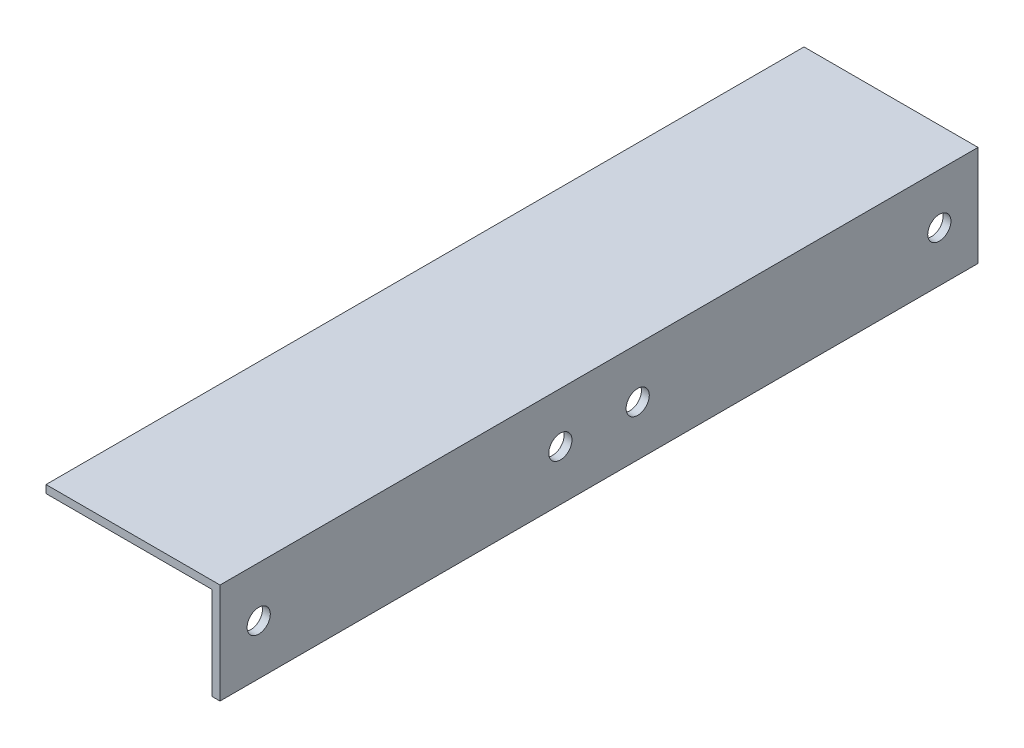
ISO-10303-21;
HEADER;
FILE_DESCRIPTION(('STEP AP214'),'2;1');
FILE_NAME('part.step','',(''),(''),'','','');
FILE_SCHEMA(('AUTOMOTIVE_DESIGN { 1 0 10303 214 1 1 1 1 }'));
ENDSEC;
DATA;
#1=APPLICATION_CONTEXT('core data for automotive mechanical design processes');
#2=APPLICATION_PROTOCOL_DEFINITION('international standard','automotive_design',2000,#1);
#3=PRODUCT_CONTEXT('',#1,'mechanical');
#4=PRODUCT('Part','Part','',(#3));
#5=PRODUCT_RELATED_PRODUCT_CATEGORY('part','',(#4));
#6=PRODUCT_DEFINITION_FORMATION('','',#4);
#7=PRODUCT_DEFINITION_CONTEXT('part definition',#1,'design');
#8=PRODUCT_DEFINITION('design','',#6,#7);
#9=PRODUCT_DEFINITION_SHAPE('','',#8);
#10=(LENGTH_UNIT() NAMED_UNIT(*) SI_UNIT(.MILLI.,.METRE.));
#11=(NAMED_UNIT(*) PLANE_ANGLE_UNIT() SI_UNIT($,.RADIAN.));
#12=(NAMED_UNIT(*) SI_UNIT($,.STERADIAN.) SOLID_ANGLE_UNIT());
#13=UNCERTAINTY_MEASURE_WITH_UNIT(LENGTH_MEASURE(1.E-05),#10,'distance_accuracy_value','');
#14=(GEOMETRIC_REPRESENTATION_CONTEXT(3) GLOBAL_UNCERTAINTY_ASSIGNED_CONTEXT((#13)) GLOBAL_UNIT_ASSIGNED_CONTEXT((#10,
#11,#12)) REPRESENTATION_CONTEXT('',''));
#15=CARTESIAN_POINT('',(0.,0.,0.));
#16=DIRECTION('',(0.,0.,1.));
#17=DIRECTION('',(1.,0.,0.));
#18=AXIS2_PLACEMENT_3D('',#15,#16,#17);
#19=CARTESIAN_POINT('',(-1.016,-1.016,98.));
#20=DIRECTION('',(0.,-1.,0.));
#21=DIRECTION('',(1.,0.,0.));
#22=AXIS2_PLACEMENT_3D('',#19,#20,#21);
#23=PLANE('',#22);
#24=DIRECTION('',(-1.,0.,0.));
#25=VECTOR('',#24,1.);
#26=CARTESIAN_POINT('',(-1.016,-1.016,0.));
#27=LINE('',#26,#25);
#28=CARTESIAN_POINT('',(-1.016,-1.016,0.));
#29=VERTEX_POINT('',#28);
#30=CARTESIAN_POINT('',(-22.5,-1.016,0.));
#31=VERTEX_POINT('',#30);
#32=EDGE_CURVE('E117',#29,#31,#27,.T.);
#33=ORIENTED_EDGE('',*,*,#32,.F.);
#34=DIRECTION('',(0.,0.,-1.));
#35=VECTOR('',#34,1.);
#36=CARTESIAN_POINT('',(-1.016,-1.016,98.));
#37=LINE('',#36,#35);
#38=CARTESIAN_POINT('',(-1.016,-1.016,98.));
#39=VERTEX_POINT('',#38);
#40=EDGE_CURVE('E11',#39,#29,#37,.T.);
#41=ORIENTED_EDGE('',*,*,#40,.F.);
#42=DIRECTION('',(-1.,0.,0.));
#43=VECTOR('',#42,1.);
#44=CARTESIAN_POINT('',(-1.016,-1.016,98.));
#45=LINE('',#44,#43);
#46=CARTESIAN_POINT('',(-22.5,-1.016,98.));
#47=VERTEX_POINT('',#46);
#48=EDGE_CURVE('E129',#39,#47,#45,.T.);
#49=ORIENTED_EDGE('',*,*,#48,.T.);
#50=DIRECTION('',(0.,0.,-1.));
#51=VECTOR('',#50,1.);
#52=CARTESIAN_POINT('',(-22.5,-1.016,98.));
#53=LINE('',#52,#51);
#54=EDGE_CURVE('E36',#47,#31,#53,.T.);
#55=ORIENTED_EDGE('',*,*,#54,.T.);
#56=EDGE_LOOP('',(#33,#41,#49,#55));
#57=FACE_BOUND('',#56,.T.);
#58=ADVANCED_FACE('F33',(#57),#23,.T.);
#59=CARTESIAN_POINT('',(-1.016,-1.016,98.));
#60=DIRECTION('',(1.,0.,0.));
#61=DIRECTION('',(0.,1.,0.));
#62=AXIS2_PLACEMENT_3D('',#59,#60,#61);
#63=PLANE('',#62);
#64=CARTESIAN_POINT('',(-1.016,-6.49999999999999,4.99999999999999));
#65=DIRECTION('',(1.,0.,0.));
#66=DIRECTION('',(0.,1.,0.));
#67=AXIS2_PLACEMENT_3D('',#64,#65,#66);
#68=CIRCLE('',#67,1.5);
#69=CARTESIAN_POINT('',(-1.016,-4.99999999999999,4.99999999999999));
#70=VERTEX_POINT('',#69);
#71=EDGE_CURVE('E162',#70,#70,#68,.T.);
#72=ORIENTED_EDGE('',*,*,#71,.T.);
#73=EDGE_LOOP('',(#72));
#74=FACE_BOUND('',#73,.T.);
#75=CARTESIAN_POINT('',(-1.016,-6.49999999999999,44.));
#76=DIRECTION('',(1.,0.,0.));
#77=DIRECTION('',(0.,1.,0.));
#78=AXIS2_PLACEMENT_3D('',#75,#76,#77);
#79=CIRCLE('',#78,1.5);
#80=CARTESIAN_POINT('',(-1.016,-4.99999999999999,44.));
#81=VERTEX_POINT('',#80);
#82=EDGE_CURVE('E156',#81,#81,#79,.T.);
#83=ORIENTED_EDGE('',*,*,#82,.T.);
#84=EDGE_LOOP('',(#83));
#85=FACE_BOUND('',#84,.T.);
#86=CARTESIAN_POINT('',(-1.016,-6.49999999999999,54.));
#87=DIRECTION('',(1.,0.,0.));
#88=DIRECTION('',(0.,1.,0.));
#89=AXIS2_PLACEMENT_3D('',#86,#87,#88);
#90=CIRCLE('',#89,1.5);
#91=CARTESIAN_POINT('',(-1.016,-4.99999999999999,54.));
#92=VERTEX_POINT('',#91);
#93=EDGE_CURVE('E150',#92,#92,#90,.T.);
#94=ORIENTED_EDGE('',*,*,#93,.T.);
#95=EDGE_LOOP('',(#94));
#96=FACE_BOUND('',#95,.T.);
#97=CARTESIAN_POINT('',(-1.016,-6.5,93.));
#98=DIRECTION('',(1.,0.,0.));
#99=DIRECTION('',(0.,1.,0.));
#100=AXIS2_PLACEMENT_3D('',#97,#98,#99);
#101=CIRCLE('',#100,1.5);
#102=CARTESIAN_POINT('',(-1.016,-5.,93.));
#103=VERTEX_POINT('',#102);
#104=EDGE_CURVE('E121',#103,#103,#101,.T.);
#105=ORIENTED_EDGE('',*,*,#104,.T.);
#106=EDGE_LOOP('',(#105));
#107=FACE_BOUND('',#106,.T.);
#108=DIRECTION('',(0.,-1.,0.));
#109=VECTOR('',#108,1.);
#110=CARTESIAN_POINT('',(-1.016,-1.016,0.));
#111=LINE('',#110,#109);
#112=CARTESIAN_POINT('',(-1.016,-13.,0.));
#113=VERTEX_POINT('',#112);
#114=EDGE_CURVE('E72',#29,#113,#111,.T.);
#115=ORIENTED_EDGE('',*,*,#114,.T.);
#116=DIRECTION('',(0.,0.,-1.));
#117=VECTOR('',#116,1.);
#118=CARTESIAN_POINT('',(-1.016,-13.,98.));
#119=LINE('',#118,#117);
#120=CARTESIAN_POINT('',(-1.016,-13.,98.));
#121=VERTEX_POINT('',#120);
#122=EDGE_CURVE('E42',#121,#113,#119,.T.);
#123=ORIENTED_EDGE('',*,*,#122,.F.);
#124=DIRECTION('',(0.,-1.,0.));
#125=VECTOR('',#124,1.);
#126=CARTESIAN_POINT('',(-1.016,-1.016,98.));
#127=LINE('',#126,#125);
#128=EDGE_CURVE('E96',#39,#121,#127,.T.);
#129=ORIENTED_EDGE('',*,*,#128,.F.);
#130=ORIENTED_EDGE('',*,*,#40,.T.);
#131=EDGE_LOOP('',(#115,#123,#129,#130));
#132=FACE_BOUND('',#131,.T.);
#133=ADVANCED_FACE('F188',(#74,#85,#96,#107,#132),#63,.F.);
#134=CARTESIAN_POINT('',(-1.016,-13.,98.));
#135=DIRECTION('',(0.,1.,0.));
#136=DIRECTION('',(0.,0.,1.));
#137=AXIS2_PLACEMENT_3D('',#134,#135,#136);
#138=PLANE('',#137);
#139=DIRECTION('',(1.,0.,0.));
#140=VECTOR('',#139,1.);
#141=CARTESIAN_POINT('',(-1.016,-13.,0.));
#142=LINE('',#141,#140);
#143=CARTESIAN_POINT('',(0.,-13.,0.));
#144=VERTEX_POINT('',#143);
#145=EDGE_CURVE('E103',#113,#144,#142,.T.);
#146=ORIENTED_EDGE('',*,*,#145,.T.);
#147=DIRECTION('',(0.,0.,-1.));
#148=VECTOR('',#147,1.);
#149=CARTESIAN_POINT('',(0.,-13.,98.));
#150=LINE('',#149,#148);
#151=CARTESIAN_POINT('',(0.,-13.,98.));
#152=VERTEX_POINT('',#151);
#153=EDGE_CURVE('E100',#152,#144,#150,.T.);
#154=ORIENTED_EDGE('',*,*,#153,.F.);
#155=DIRECTION('',(1.,0.,0.));
#156=VECTOR('',#155,1.);
#157=CARTESIAN_POINT('',(-1.016,-13.,98.));
#158=LINE('',#157,#156);
#159=EDGE_CURVE('E91',#121,#152,#158,.T.);
#160=ORIENTED_EDGE('',*,*,#159,.F.);
#161=ORIENTED_EDGE('',*,*,#122,.T.);
#162=EDGE_LOOP('',(#146,#154,#160,#161));
#163=FACE_BOUND('',#162,.T.);
#164=ADVANCED_FACE('F101',(#163),#138,.F.);
#165=CARTESIAN_POINT('',(0.,0.,98.));
#166=DIRECTION('',(1.,0.,0.));
#167=DIRECTION('',(0.,1.,0.));
#168=AXIS2_PLACEMENT_3D('',#165,#166,#167);
#169=PLANE('',#168);
#170=CARTESIAN_POINT('',(0.,-6.49999999999999,4.99999999999999));
#171=DIRECTION('',(1.,0.,0.));
#172=DIRECTION('',(0.,-1.,0.));
#173=AXIS2_PLACEMENT_3D('',#170,#171,#172);
#174=CIRCLE('',#173,1.5);
#175=CARTESIAN_POINT('',(0.,-7.99999999999999,4.99999999999999));
#176=VERTEX_POINT('',#175);
#177=EDGE_CURVE('E165',#176,#176,#174,.T.);
#178=ORIENTED_EDGE('',*,*,#177,.F.);
#179=EDGE_LOOP('',(#178));
#180=FACE_BOUND('',#179,.T.);
#181=CARTESIAN_POINT('',(0.,-6.49999999999999,44.));
#182=DIRECTION('',(1.,0.,0.));
#183=DIRECTION('',(0.,-1.,0.));
#184=AXIS2_PLACEMENT_3D('',#181,#182,#183);
#185=CIRCLE('',#184,1.5);
#186=CARTESIAN_POINT('',(0.,-8.,44.));
#187=VERTEX_POINT('',#186);
#188=EDGE_CURVE('E159',#187,#187,#185,.T.);
#189=ORIENTED_EDGE('',*,*,#188,.F.);
#190=EDGE_LOOP('',(#189));
#191=FACE_BOUND('',#190,.T.);
#192=CARTESIAN_POINT('',(0.,-6.49999999999999,54.));
#193=DIRECTION('',(1.,0.,0.));
#194=DIRECTION('',(0.,1.,0.));
#195=AXIS2_PLACEMENT_3D('',#192,#193,#194);
#196=CIRCLE('',#195,1.5);
#197=CARTESIAN_POINT('',(0.,-4.99999999999999,54.));
#198=VERTEX_POINT('',#197);
#199=EDGE_CURVE('E153',#198,#198,#196,.T.);
#200=ORIENTED_EDGE('',*,*,#199,.F.);
#201=EDGE_LOOP('',(#200));
#202=FACE_BOUND('',#201,.T.);
#203=CARTESIAN_POINT('',(0.,-6.5,93.));
#204=DIRECTION('',(1.,0.,0.));
#205=DIRECTION('',(0.,1.,0.));
#206=AXIS2_PLACEMENT_3D('',#203,#204,#205);
#207=CIRCLE('',#206,1.5);
#208=CARTESIAN_POINT('',(0.,-5.,93.));
#209=VERTEX_POINT('',#208);
#210=EDGE_CURVE('E147',#209,#209,#207,.T.);
#211=ORIENTED_EDGE('',*,*,#210,.F.);
#212=EDGE_LOOP('',(#211));
#213=FACE_BOUND('',#212,.T.);
#214=DIRECTION('',(0.,-1.,0.));
#215=VECTOR('',#214,1.);
#216=CARTESIAN_POINT('',(0.,0.,0.));
#217=LINE('',#216,#215);
#218=CARTESIAN_POINT('',(0.,0.,0.));
#219=VERTEX_POINT('',#218);
#220=EDGE_CURVE('E126',#219,#144,#217,.T.);
#221=ORIENTED_EDGE('',*,*,#220,.F.);
#222=DIRECTION('',(0.,0.,-1.));
#223=VECTOR('',#222,1.);
#224=CARTESIAN_POINT('',(0.,0.,98.));
#225=LINE('',#224,#223);
#226=CARTESIAN_POINT('',(0.,0.,98.));
#227=VERTEX_POINT('',#226);
#228=EDGE_CURVE('E107',#227,#219,#225,.T.);
#229=ORIENTED_EDGE('',*,*,#228,.F.);
#230=DIRECTION('',(0.,-1.,0.));
#231=VECTOR('',#230,1.);
#232=CARTESIAN_POINT('',(0.,0.,98.));
#233=LINE('',#232,#231);
#234=EDGE_CURVE('E95',#227,#152,#233,.T.);
#235=ORIENTED_EDGE('',*,*,#234,.T.);
#236=ORIENTED_EDGE('',*,*,#153,.T.);
#237=EDGE_LOOP('',(#221,#229,#235,#236));
#238=FACE_BOUND('',#237,.T.);
#239=ADVANCED_FACE('F109',(#180,#191,#202,#213,#238),#169,.T.);
#240=CARTESIAN_POINT('',(0.,0.,98.));
#241=DIRECTION('',(0.,-1.,0.));
#242=DIRECTION('',(1.,0.,0.));
#243=AXIS2_PLACEMENT_3D('',#240,#241,#242);
#244=PLANE('',#243);
#245=DIRECTION('',(-1.,0.,0.));
#246=VECTOR('',#245,1.);
#247=CARTESIAN_POINT('',(0.,0.,0.));
#248=LINE('',#247,#246);
#249=CARTESIAN_POINT('',(-22.5,0.,0.));
#250=VERTEX_POINT('',#249);
#251=EDGE_CURVE('E124',#219,#250,#248,.T.);
#252=ORIENTED_EDGE('',*,*,#251,.T.);
#253=DIRECTION('',(0.,0.,-1.));
#254=VECTOR('',#253,1.);
#255=CARTESIAN_POINT('',(-22.5,0.,98.));
#256=LINE('',#255,#254);
#257=CARTESIAN_POINT('',(-22.5,0.,98.));
#258=VERTEX_POINT('',#257);
#259=EDGE_CURVE('E132',#258,#250,#256,.T.);
#260=ORIENTED_EDGE('',*,*,#259,.F.);
#261=DIRECTION('',(-1.,0.,0.));
#262=VECTOR('',#261,1.);
#263=CARTESIAN_POINT('',(0.,0.,98.));
#264=LINE('',#263,#262);
#265=EDGE_CURVE('E111',#227,#258,#264,.T.);
#266=ORIENTED_EDGE('',*,*,#265,.F.);
#267=ORIENTED_EDGE('',*,*,#228,.T.);
#268=EDGE_LOOP('',(#252,#260,#266,#267));
#269=FACE_BOUND('',#268,.T.);
#270=ADVANCED_FACE('F142',(#269),#244,.F.);
#271=CARTESIAN_POINT('',(-22.5,0.,98.));
#272=DIRECTION('',(1.,0.,0.));
#273=DIRECTION('',(0.,0.,-1.));
#274=AXIS2_PLACEMENT_3D('',#271,#272,#273);
#275=PLANE('',#274);
#276=DIRECTION('',(0.,-1.,0.));
#277=VECTOR('',#276,1.);
#278=CARTESIAN_POINT('',(-22.5,0.,0.));
#279=LINE('',#278,#277);
#280=EDGE_CURVE('E120',#250,#31,#279,.T.);
#281=ORIENTED_EDGE('',*,*,#280,.T.);
#282=ORIENTED_EDGE('',*,*,#54,.F.);
#283=DIRECTION('',(0.,-1.,0.));
#284=VECTOR('',#283,1.);
#285=CARTESIAN_POINT('',(-22.5,0.,98.));
#286=LINE('',#285,#284);
#287=EDGE_CURVE('E82',#258,#47,#286,.T.);
#288=ORIENTED_EDGE('',*,*,#287,.F.);
#289=ORIENTED_EDGE('',*,*,#259,.T.);
#290=EDGE_LOOP('',(#281,#282,#288,#289));
#291=FACE_BOUND('',#290,.T.);
#292=ADVANCED_FACE('F137',(#291),#275,.F.);
#293=CARTESIAN_POINT('',(0.,0.,98.));
#294=DIRECTION('',(0.,0.,1.));
#295=DIRECTION('',(1.,0.,0.));
#296=AXIS2_PLACEMENT_3D('',#293,#294,#295);
#297=PLANE('',#296);
#298=ORIENTED_EDGE('',*,*,#48,.F.);
#299=ORIENTED_EDGE('',*,*,#128,.T.);
#300=ORIENTED_EDGE('',*,*,#159,.T.);
#301=ORIENTED_EDGE('',*,*,#234,.F.);
#302=ORIENTED_EDGE('',*,*,#265,.T.);
#303=ORIENTED_EDGE('',*,*,#287,.T.);
#304=EDGE_LOOP('',(#298,#299,#300,#301,#302,#303));
#305=FACE_BOUND('',#304,.T.);
#306=ADVANCED_FACE('F93',(#305),#297,.T.);
#307=CARTESIAN_POINT('',(0.,0.,0.));
#308=DIRECTION('',(0.,0.,1.));
#309=DIRECTION('',(1.,0.,0.));
#310=AXIS2_PLACEMENT_3D('',#307,#308,#309);
#311=PLANE('',#310);
#312=ORIENTED_EDGE('',*,*,#32,.T.);
#313=ORIENTED_EDGE('',*,*,#280,.F.);
#314=ORIENTED_EDGE('',*,*,#251,.F.);
#315=ORIENTED_EDGE('',*,*,#220,.T.);
#316=ORIENTED_EDGE('',*,*,#145,.F.);
#317=ORIENTED_EDGE('',*,*,#114,.F.);
#318=EDGE_LOOP('',(#312,#313,#314,#315,#316,#317));
#319=FACE_BOUND('',#318,.T.);
#320=ADVANCED_FACE('F140',(#319),#311,.F.);
#321=CARTESIAN_POINT('',(-40.,-6.50000000000001,93.));
#322=DIRECTION('',(1.,0.,0.));
#323=DIRECTION('',(0.,1.,0.));
#324=AXIS2_PLACEMENT_3D('',#321,#322,#323);
#325=CYLINDRICAL_SURFACE('',#324,1.5);
#326=ORIENTED_EDGE('',*,*,#210,.T.);
#327=EDGE_LOOP('',(#326));
#328=FACE_BOUND('',#327,.T.);
#329=ORIENTED_EDGE('',*,*,#104,.F.);
#330=EDGE_LOOP('',(#329));
#331=FACE_BOUND('',#330,.T.);
#332=ADVANCED_FACE('F181',(#328,#331),#325,.F.);
#333=CARTESIAN_POINT('',(-40.,-6.5,54.));
#334=DIRECTION('',(1.,0.,0.));
#335=DIRECTION('',(0.,1.,0.));
#336=AXIS2_PLACEMENT_3D('',#333,#334,#335);
#337=CYLINDRICAL_SURFACE('',#336,1.5);
#338=ORIENTED_EDGE('',*,*,#199,.T.);
#339=EDGE_LOOP('',(#338));
#340=FACE_BOUND('',#339,.T.);
#341=ORIENTED_EDGE('',*,*,#93,.F.);
#342=EDGE_LOOP('',(#341));
#343=FACE_BOUND('',#342,.T.);
#344=ADVANCED_FACE('F184',(#340,#343),#337,.F.);
#345=CARTESIAN_POINT('',(-40.,-6.5,44.));
#346=DIRECTION('',(1.,0.,0.));
#347=DIRECTION('',(0.,1.,0.));
#348=AXIS2_PLACEMENT_3D('',#345,#346,#347);
#349=CYLINDRICAL_SURFACE('',#348,1.5);
#350=ORIENTED_EDGE('',*,*,#188,.T.);
#351=EDGE_LOOP('',(#350));
#352=FACE_BOUND('',#351,.T.);
#353=ORIENTED_EDGE('',*,*,#82,.F.);
#354=EDGE_LOOP('',(#353));
#355=FACE_BOUND('',#354,.T.);
#356=ADVANCED_FACE('F212',(#352,#355),#349,.F.);
#357=CARTESIAN_POINT('',(-40.,-6.49999999999999,4.99999999999999));
#358=DIRECTION('',(1.,0.,0.));
#359=DIRECTION('',(0.,1.,0.));
#360=AXIS2_PLACEMENT_3D('',#357,#358,#359);
#361=CYLINDRICAL_SURFACE('',#360,1.5);
#362=ORIENTED_EDGE('',*,*,#177,.T.);
#363=EDGE_LOOP('',(#362));
#364=FACE_BOUND('',#363,.T.);
#365=ORIENTED_EDGE('',*,*,#71,.F.);
#366=EDGE_LOOP('',(#365));
#367=FACE_BOUND('',#366,.T.);
#368=ADVANCED_FACE('F169',(#364,#367),#361,.F.);
#369=CLOSED_SHELL('',(#58,#133,#164,#239,#270,#292,#306,#320,#332,#344,#356,#368));
#370=MANIFOLD_SOLID_BREP('B2',#369);
#371=ADVANCED_BREP_SHAPE_REPRESENTATION('',(#18,#370),#14);
#372=SHAPE_DEFINITION_REPRESENTATION(#9,#371);
ENDSEC;
END-ISO-10303-21;
